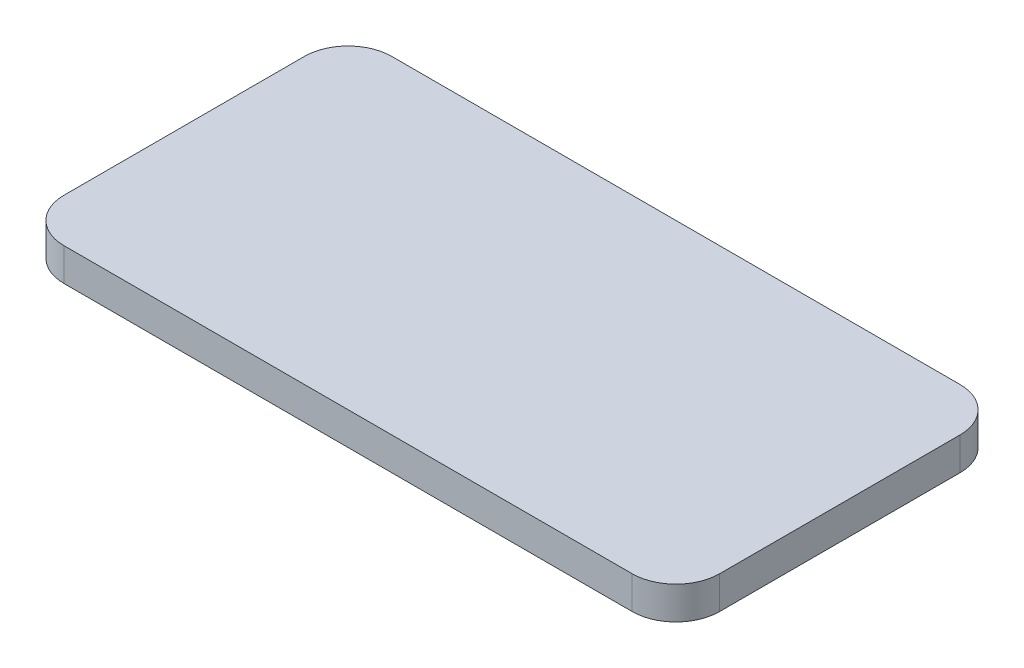
ISO-10303-21;
HEADER;
FILE_DESCRIPTION(('STEP AP214'),'2;1');
FILE_NAME('part.step','',(''),(''),'','','');
FILE_SCHEMA(('AUTOMOTIVE_DESIGN { 1 0 10303 214 1 1 1 1 }'));
ENDSEC;
DATA;
#1=APPLICATION_CONTEXT('core data for automotive mechanical design processes');
#2=APPLICATION_PROTOCOL_DEFINITION('international standard','automotive_design',2000,#1);
#3=PRODUCT_CONTEXT('',#1,'mechanical');
#4=PRODUCT('Part','Part','',(#3));
#5=PRODUCT_RELATED_PRODUCT_CATEGORY('part','',(#4));
#6=PRODUCT_DEFINITION_FORMATION('','',#4);
#7=PRODUCT_DEFINITION_CONTEXT('part definition',#1,'design');
#8=PRODUCT_DEFINITION('design','',#6,#7);
#9=PRODUCT_DEFINITION_SHAPE('','',#8);
#10=(LENGTH_UNIT() NAMED_UNIT(*) SI_UNIT(.MILLI.,.METRE.));
#11=(NAMED_UNIT(*) PLANE_ANGLE_UNIT() SI_UNIT($,.RADIAN.));
#12=(NAMED_UNIT(*) SI_UNIT($,.STERADIAN.) SOLID_ANGLE_UNIT());
#13=UNCERTAINTY_MEASURE_WITH_UNIT(LENGTH_MEASURE(1.E-05),#10,'distance_accuracy_value','');
#14=(GEOMETRIC_REPRESENTATION_CONTEXT(3) GLOBAL_UNCERTAINTY_ASSIGNED_CONTEXT((#13)) GLOBAL_UNIT_ASSIGNED_CONTEXT((#10,
#11,#12)) REPRESENTATION_CONTEXT('',''));
#15=CARTESIAN_POINT('',(0.,0.,0.));
#16=DIRECTION('',(0.,0.,1.));
#17=DIRECTION('',(1.,0.,0.));
#18=AXIS2_PLACEMENT_3D('',#15,#16,#17);
#19=CARTESIAN_POINT('',(-13.,1.5,5.5));
#20=DIRECTION('',(0.,-1.,0.));
#21=DIRECTION('',(0.,0.,-1.));
#22=AXIS2_PLACEMENT_3D('',#19,#20,#21);
#23=CYLINDRICAL_SURFACE('',#22,2.);
#24=CARTESIAN_POINT('',(-13.,0.,5.5));
#25=DIRECTION('',(0.,1.,0.));
#26=DIRECTION('',(0.,0.,-1.));
#27=AXIS2_PLACEMENT_3D('',#24,#25,#26);
#28=CIRCLE('',#27,2.);
#29=CARTESIAN_POINT('',(-15.,0.,5.49999999999999));
#30=VERTEX_POINT('',#29);
#31=CARTESIAN_POINT('',(-13.,0.,7.5));
#32=VERTEX_POINT('',#31);
#33=EDGE_CURVE('E135',#30,#32,#28,.T.);
#34=ORIENTED_EDGE('',*,*,#33,.T.);
#35=DIRECTION('',(0.,-1.,0.));
#36=VECTOR('',#35,1.);
#37=CARTESIAN_POINT('',(-13.,1.5,7.5));
#38=LINE('',#37,#36);
#39=CARTESIAN_POINT('',(-13.,1.5,7.5));
#40=VERTEX_POINT('',#39);
#41=EDGE_CURVE('E11',#40,#32,#38,.T.);
#42=ORIENTED_EDGE('',*,*,#41,.F.);
#43=CARTESIAN_POINT('',(-13.,1.5,5.5));
#44=DIRECTION('',(0.,1.,0.));
#45=DIRECTION('',(0.,0.,-1.));
#46=AXIS2_PLACEMENT_3D('',#43,#44,#45);
#47=CIRCLE('',#46,2.);
#48=CARTESIAN_POINT('',(-15.,1.5,5.49999999999999));
#49=VERTEX_POINT('',#48);
#50=EDGE_CURVE('E149',#49,#40,#47,.T.);
#51=ORIENTED_EDGE('',*,*,#50,.F.);
#52=DIRECTION('',(0.,-1.,0.));
#53=VECTOR('',#52,1.);
#54=CARTESIAN_POINT('',(-15.,1.5,5.49999999999999));
#55=LINE('',#54,#53);
#56=EDGE_CURVE('E131',#49,#30,#55,.T.);
#57=ORIENTED_EDGE('',*,*,#56,.T.);
#58=EDGE_LOOP('',(#34,#42,#51,#57));
#59=FACE_BOUND('',#58,.T.);
#60=ADVANCED_FACE('F39',(#59),#23,.T.);
#61=CARTESIAN_POINT('',(-13.,1.5,7.5));
#62=DIRECTION('',(0.,0.,-1.));
#63=DIRECTION('',(-1.,0.,0.));
#64=AXIS2_PLACEMENT_3D('',#61,#62,#63);
#65=PLANE('',#64);
#66=DIRECTION('',(1.,0.,0.));
#67=VECTOR('',#66,1.);
#68=CARTESIAN_POINT('',(-13.,0.,7.5));
#69=LINE('',#68,#67);
#70=CARTESIAN_POINT('',(13.,0.,7.5));
#71=VERTEX_POINT('',#70);
#72=EDGE_CURVE('E138',#32,#71,#69,.T.);
#73=ORIENTED_EDGE('',*,*,#72,.T.);
#74=DIRECTION('',(0.,-1.,0.));
#75=VECTOR('',#74,1.);
#76=CARTESIAN_POINT('',(13.,1.5,7.5));
#77=LINE('',#76,#75);
#78=CARTESIAN_POINT('',(13.,1.5,7.5));
#79=VERTEX_POINT('',#78);
#80=EDGE_CURVE('E47',#79,#71,#77,.T.);
#81=ORIENTED_EDGE('',*,*,#80,.F.);
#82=DIRECTION('',(1.,0.,0.));
#83=VECTOR('',#82,1.);
#84=CARTESIAN_POINT('',(-13.,1.5,7.5));
#85=LINE('',#84,#83);
#86=EDGE_CURVE('E98',#40,#79,#85,.T.);
#87=ORIENTED_EDGE('',*,*,#86,.F.);
#88=ORIENTED_EDGE('',*,*,#41,.T.);
#89=EDGE_LOOP('',(#73,#81,#87,#88));
#90=FACE_BOUND('',#89,.T.);
#91=ADVANCED_FACE('F184',(#90),#65,.F.);
#92=CARTESIAN_POINT('',(13.,1.5,5.5));
#93=DIRECTION('',(0.,-1.,0.));
#94=DIRECTION('',(0.,0.,-1.));
#95=AXIS2_PLACEMENT_3D('',#92,#93,#94);
#96=CYLINDRICAL_SURFACE('',#95,2.);
#97=CARTESIAN_POINT('',(13.,0.,5.5));
#98=DIRECTION('',(0.,1.,0.));
#99=DIRECTION('',(0.,0.,1.));
#100=AXIS2_PLACEMENT_3D('',#97,#98,#99);
#101=CIRCLE('',#100,2.);
#102=CARTESIAN_POINT('',(15.,0.,5.49999999999999));
#103=VERTEX_POINT('',#102);
#104=EDGE_CURVE('E140',#71,#103,#101,.T.);
#105=ORIENTED_EDGE('',*,*,#104,.T.);
#106=DIRECTION('',(0.,-1.,0.));
#107=VECTOR('',#106,1.);
#108=CARTESIAN_POINT('',(15.,1.5,5.49999999999999));
#109=LINE('',#108,#107);
#110=CARTESIAN_POINT('',(15.,1.5,5.49999999999999));
#111=VERTEX_POINT('',#110);
#112=EDGE_CURVE('E156',#111,#103,#109,.T.);
#113=ORIENTED_EDGE('',*,*,#112,.F.);
#114=CARTESIAN_POINT('',(13.,1.5,5.5));
#115=DIRECTION('',(0.,1.,0.));
#116=DIRECTION('',(0.,0.,1.));
#117=AXIS2_PLACEMENT_3D('',#114,#115,#116);
#118=CIRCLE('',#117,2.);
#119=EDGE_CURVE('E164',#79,#111,#118,.T.);
#120=ORIENTED_EDGE('',*,*,#119,.F.);
#121=ORIENTED_EDGE('',*,*,#80,.T.);
#122=EDGE_LOOP('',(#105,#113,#120,#121));
#123=FACE_BOUND('',#122,.T.);
#124=ADVANCED_FACE('F162',(#123),#96,.T.);
#125=CARTESIAN_POINT('',(15.,1.5,5.49999999999999));
#126=DIRECTION('',(-1.,0.,0.));
#127=DIRECTION('',(0.,0.,1.));
#128=AXIS2_PLACEMENT_3D('',#125,#126,#127);
#129=PLANE('',#128);
#130=DIRECTION('',(0.,0.,-1.));
#131=VECTOR('',#130,1.);
#132=CARTESIAN_POINT('',(15.,0.,5.49999999999999));
#133=LINE('',#132,#131);
#134=CARTESIAN_POINT('',(15.,0.,-5.49999999999999));
#135=VERTEX_POINT('',#134);
#136=EDGE_CURVE('E142',#103,#135,#133,.T.);
#137=ORIENTED_EDGE('',*,*,#136,.T.);
#138=DIRECTION('',(0.,-1.,0.));
#139=VECTOR('',#138,1.);
#140=CARTESIAN_POINT('',(15.,1.5,-5.49999999999999));
#141=LINE('',#140,#139);
#142=CARTESIAN_POINT('',(15.,1.5,-5.49999999999999));
#143=VERTEX_POINT('',#142);
#144=EDGE_CURVE('E153',#143,#135,#141,.T.);
#145=ORIENTED_EDGE('',*,*,#144,.F.);
#146=DIRECTION('',(0.,0.,-1.));
#147=VECTOR('',#146,1.);
#148=CARTESIAN_POINT('',(15.,1.5,5.49999999999999));
#149=LINE('',#148,#147);
#150=EDGE_CURVE('E176',#111,#143,#149,.T.);
#151=ORIENTED_EDGE('',*,*,#150,.F.);
#152=ORIENTED_EDGE('',*,*,#112,.T.);
#153=EDGE_LOOP('',(#137,#145,#151,#152));
#154=FACE_BOUND('',#153,.T.);
#155=ADVANCED_FACE('F172',(#154),#129,.F.);
#156=CARTESIAN_POINT('',(13.,1.5,-5.5));
#157=DIRECTION('',(0.,-1.,0.));
#158=DIRECTION('',(0.,0.,-1.));
#159=AXIS2_PLACEMENT_3D('',#156,#157,#158);
#160=CYLINDRICAL_SURFACE('',#159,2.);
#161=CARTESIAN_POINT('',(13.,0.,-5.5));
#162=DIRECTION('',(0.,1.,0.));
#163=DIRECTION('',(0.,0.,-1.));
#164=AXIS2_PLACEMENT_3D('',#161,#162,#163);
#165=CIRCLE('',#164,2.);
#166=CARTESIAN_POINT('',(13.,0.,-7.5));
#167=VERTEX_POINT('',#166);
#168=EDGE_CURVE('E144',#135,#167,#165,.T.);
#169=ORIENTED_EDGE('',*,*,#168,.T.);
#170=DIRECTION('',(0.,-1.,0.));
#171=VECTOR('',#170,1.);
#172=CARTESIAN_POINT('',(13.,1.5,-7.5));
#173=LINE('',#172,#171);
#174=CARTESIAN_POINT('',(13.,1.5,-7.5));
#175=VERTEX_POINT('',#174);
#176=EDGE_CURVE('E126',#175,#167,#173,.T.);
#177=ORIENTED_EDGE('',*,*,#176,.F.);
#178=CARTESIAN_POINT('',(13.,1.5,-5.5));
#179=DIRECTION('',(0.,1.,0.));
#180=DIRECTION('',(0.,0.,-1.));
#181=AXIS2_PLACEMENT_3D('',#178,#179,#180);
#182=CIRCLE('',#181,2.);
#183=EDGE_CURVE('E117',#143,#175,#182,.T.);
#184=ORIENTED_EDGE('',*,*,#183,.F.);
#185=ORIENTED_EDGE('',*,*,#144,.T.);
#186=EDGE_LOOP('',(#169,#177,#184,#185));
#187=FACE_BOUND('',#186,.T.);
#188=ADVANCED_FACE('F175',(#187),#160,.T.);
#189=CARTESIAN_POINT('',(-13.,1.5,-7.5));
#190=DIRECTION('',(0.,0.,1.));
#191=DIRECTION('',(1.,0.,0.));
#192=AXIS2_PLACEMENT_3D('',#189,#190,#191);
#193=PLANE('',#192);
#194=DIRECTION('',(-1.,0.,0.));
#195=VECTOR('',#194,1.);
#196=CARTESIAN_POINT('',(-13.,0.,-7.5));
#197=LINE('',#196,#195);
#198=CARTESIAN_POINT('',(-13.,0.,-7.5));
#199=VERTEX_POINT('',#198);
#200=EDGE_CURVE('E125',#167,#199,#197,.T.);
#201=ORIENTED_EDGE('',*,*,#200,.T.);
#202=DIRECTION('',(0.,-1.,0.));
#203=VECTOR('',#202,1.);
#204=CARTESIAN_POINT('',(-13.,1.5,-7.5));
#205=LINE('',#204,#203);
#206=CARTESIAN_POINT('',(-13.,1.5,-7.5));
#207=VERTEX_POINT('',#206);
#208=EDGE_CURVE('E122',#207,#199,#205,.T.);
#209=ORIENTED_EDGE('',*,*,#208,.F.);
#210=DIRECTION('',(-1.,0.,0.));
#211=VECTOR('',#210,1.);
#212=CARTESIAN_POINT('',(-13.,1.5,-7.5));
#213=LINE('',#212,#211);
#214=EDGE_CURVE('E111',#175,#207,#213,.T.);
#215=ORIENTED_EDGE('',*,*,#214,.F.);
#216=ORIENTED_EDGE('',*,*,#176,.T.);
#217=EDGE_LOOP('',(#201,#209,#215,#216));
#218=FACE_BOUND('',#217,.T.);
#219=ADVANCED_FACE('F123',(#218),#193,.F.);
#220=CARTESIAN_POINT('',(-13.,1.5,-5.5));
#221=DIRECTION('',(0.,-1.,0.));
#222=DIRECTION('',(0.,0.,-1.));
#223=AXIS2_PLACEMENT_3D('',#220,#221,#222);
#224=CYLINDRICAL_SURFACE('',#223,2.);
#225=CARTESIAN_POINT('',(-13.,0.,-5.5));
#226=DIRECTION('',(0.,1.,0.));
#227=DIRECTION('',(0.,0.,-1.));
#228=AXIS2_PLACEMENT_3D('',#225,#226,#227);
#229=CIRCLE('',#228,2.);
#230=CARTESIAN_POINT('',(-15.,0.,-5.49999999999998));
#231=VERTEX_POINT('',#230);
#232=EDGE_CURVE('E84',#199,#231,#229,.T.);
#233=ORIENTED_EDGE('',*,*,#232,.T.);
#234=DIRECTION('',(0.,-1.,0.));
#235=VECTOR('',#234,1.);
#236=CARTESIAN_POINT('',(-15.,1.5,-5.49999999999998));
#237=LINE('',#236,#235);
#238=CARTESIAN_POINT('',(-15.,1.5,-5.49999999999998));
#239=VERTEX_POINT('',#238);
#240=EDGE_CURVE('E127',#239,#231,#237,.T.);
#241=ORIENTED_EDGE('',*,*,#240,.F.);
#242=CARTESIAN_POINT('',(-13.,1.5,-5.5));
#243=DIRECTION('',(0.,1.,0.));
#244=DIRECTION('',(0.,0.,-1.));
#245=AXIS2_PLACEMENT_3D('',#242,#243,#244);
#246=CIRCLE('',#245,2.);
#247=EDGE_CURVE('E115',#207,#239,#246,.T.);
#248=ORIENTED_EDGE('',*,*,#247,.F.);
#249=ORIENTED_EDGE('',*,*,#208,.T.);
#250=EDGE_LOOP('',(#233,#241,#248,#249));
#251=FACE_BOUND('',#250,.T.);
#252=ADVANCED_FACE('F129',(#251),#224,.T.);
#253=CARTESIAN_POINT('',(-15.,1.5,5.49999999999999));
#254=DIRECTION('',(1.,0.,0.));
#255=DIRECTION('',(0.,0.,-1.));
#256=AXIS2_PLACEMENT_3D('',#253,#254,#255);
#257=PLANE('',#256);
#258=DIRECTION('',(0.,0.,1.));
#259=VECTOR('',#258,1.);
#260=CARTESIAN_POINT('',(-15.,0.,5.49999999999999));
#261=LINE('',#260,#259);
#262=EDGE_CURVE('E90',#231,#30,#261,.T.);
#263=ORIENTED_EDGE('',*,*,#262,.T.);
#264=ORIENTED_EDGE('',*,*,#56,.F.);
#265=DIRECTION('',(0.,0.,1.));
#266=VECTOR('',#265,1.);
#267=CARTESIAN_POINT('',(-15.,1.5,5.49999999999999));
#268=LINE('',#267,#266);
#269=EDGE_CURVE('E55',#239,#49,#268,.T.);
#270=ORIENTED_EDGE('',*,*,#269,.F.);
#271=ORIENTED_EDGE('',*,*,#240,.T.);
#272=EDGE_LOOP('',(#263,#264,#270,#271));
#273=FACE_BOUND('',#272,.T.);
#274=ADVANCED_FACE('F200',(#273),#257,.F.);
#275=CARTESIAN_POINT('',(-13.,1.5,5.5));
#276=DIRECTION('',(0.,-1.,0.));
#277=DIRECTION('',(0.,0.,-1.));
#278=AXIS2_PLACEMENT_3D('',#275,#276,#277);
#279=PLANE('',#278);
#280=ORIENTED_EDGE('',*,*,#50,.T.);
#281=ORIENTED_EDGE('',*,*,#86,.T.);
#282=ORIENTED_EDGE('',*,*,#119,.T.);
#283=ORIENTED_EDGE('',*,*,#150,.T.);
#284=ORIENTED_EDGE('',*,*,#183,.T.);
#285=ORIENTED_EDGE('',*,*,#214,.T.);
#286=ORIENTED_EDGE('',*,*,#247,.T.);
#287=ORIENTED_EDGE('',*,*,#269,.T.);
#288=EDGE_LOOP('',(#280,#281,#282,#283,#284,#285,#286,#287));
#289=FACE_BOUND('',#288,.T.);
#290=ADVANCED_FACE('F113',(#289),#279,.F.);
#291=CARTESIAN_POINT('',(-13.,0.,5.5));
#292=DIRECTION('',(0.,-1.,0.));
#293=DIRECTION('',(0.,0.,-1.));
#294=AXIS2_PLACEMENT_3D('',#291,#292,#293);
#295=PLANE('',#294);
#296=ORIENTED_EDGE('',*,*,#33,.F.);
#297=ORIENTED_EDGE('',*,*,#262,.F.);
#298=ORIENTED_EDGE('',*,*,#232,.F.);
#299=ORIENTED_EDGE('',*,*,#200,.F.);
#300=ORIENTED_EDGE('',*,*,#168,.F.);
#301=ORIENTED_EDGE('',*,*,#136,.F.);
#302=ORIENTED_EDGE('',*,*,#104,.F.);
#303=ORIENTED_EDGE('',*,*,#72,.F.);
#304=EDGE_LOOP('',(#296,#297,#298,#299,#300,#301,#302,#303));
#305=FACE_BOUND('',#304,.T.);
#306=ADVANCED_FACE('F168',(#305),#295,.T.);
#307=CLOSED_SHELL('',(#60,#91,#124,#155,#188,#219,#252,#274,#290,#306));
#308=MANIFOLD_SOLID_BREP('B2',#307);
#309=ADVANCED_BREP_SHAPE_REPRESENTATION('',(#18,#308),#14);
#310=SHAPE_DEFINITION_REPRESENTATION(#9,#309);
ENDSEC;
END-ISO-10303-21;
